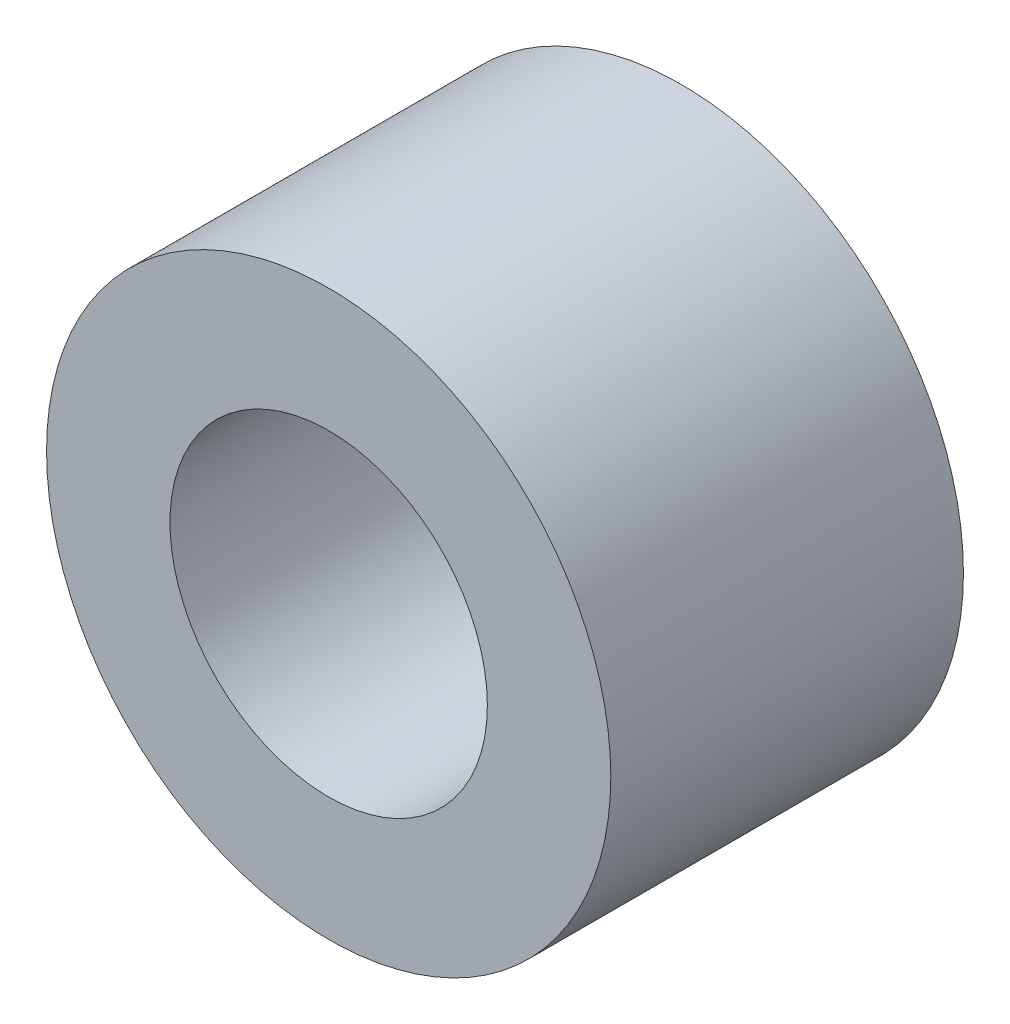
ISO-10303-21;
HEADER;
FILE_DESCRIPTION(('STEP AP214'),'2;1');
FILE_NAME('part.step','',(''),(''),'','','');
FILE_SCHEMA(('AUTOMOTIVE_DESIGN { 1 0 10303 214 1 1 1 1 }'));
ENDSEC;
DATA;
#1=APPLICATION_CONTEXT('core data for automotive mechanical design processes');
#2=APPLICATION_PROTOCOL_DEFINITION('international standard','automotive_design',2000,#1);
#3=PRODUCT_CONTEXT('',#1,'mechanical');
#4=PRODUCT('Part','Part','',(#3));
#5=PRODUCT_RELATED_PRODUCT_CATEGORY('part','',(#4));
#6=PRODUCT_DEFINITION_FORMATION('','',#4);
#7=PRODUCT_DEFINITION_CONTEXT('part definition',#1,'design');
#8=PRODUCT_DEFINITION('design','',#6,#7);
#9=PRODUCT_DEFINITION_SHAPE('','',#8);
#10=(LENGTH_UNIT() NAMED_UNIT(*) SI_UNIT(.MILLI.,.METRE.));
#11=(NAMED_UNIT(*) PLANE_ANGLE_UNIT() SI_UNIT($,.RADIAN.));
#12=(NAMED_UNIT(*) SI_UNIT($,.STERADIAN.) SOLID_ANGLE_UNIT());
#13=UNCERTAINTY_MEASURE_WITH_UNIT(LENGTH_MEASURE(1.E-05),#10,'distance_accuracy_value','');
#14=(GEOMETRIC_REPRESENTATION_CONTEXT(3) GLOBAL_UNCERTAINTY_ASSIGNED_CONTEXT((#13)) GLOBAL_UNIT_ASSIGNED_CONTEXT((#10,
#11,#12)) REPRESENTATION_CONTEXT('',''));
#15=CARTESIAN_POINT('',(0.,0.,0.));
#16=DIRECTION('',(0.,0.,1.));
#17=DIRECTION('',(1.,0.,0.));
#18=AXIS2_PLACEMENT_3D('',#15,#16,#17);
#19=CARTESIAN_POINT('',(0.,0.,5.));
#20=DIRECTION('',(0.,0.,1.));
#21=DIRECTION('',(1.,0.,0.));
#22=AXIS2_PLACEMENT_3D('',#19,#20,#21);
#23=PLANE('',#22);
#24=CARTESIAN_POINT('',(0.,0.,5.));
#25=DIRECTION('',(0.,0.,1.));
#26=DIRECTION('',(1.,0.,0.));
#27=AXIS2_PLACEMENT_3D('',#24,#25,#26);
#28=CIRCLE('',#27,4.);
#29=CARTESIAN_POINT('',(4.,0.,5.));
#30=VERTEX_POINT('',#29);
#31=EDGE_CURVE('E10',#30,#30,#28,.T.);
#32=ORIENTED_EDGE('',*,*,#31,.T.);
#33=EDGE_LOOP('',(#32));
#34=FACE_BOUND('',#33,.T.);
#35=CARTESIAN_POINT('',(0.,0.,5.));
#36=DIRECTION('',(0.,0.,1.));
#37=DIRECTION('',(1.,0.,0.));
#38=AXIS2_PLACEMENT_3D('',#35,#36,#37);
#39=CIRCLE('',#38,2.25);
#40=CARTESIAN_POINT('',(2.25,0.,5.));
#41=VERTEX_POINT('',#40);
#42=EDGE_CURVE('E48',#41,#41,#39,.T.);
#43=ORIENTED_EDGE('',*,*,#42,.F.);
#44=EDGE_LOOP('',(#43));
#45=FACE_BOUND('',#44,.T.);
#46=ADVANCED_FACE('F37',(#34,#45),#23,.T.);
#47=CARTESIAN_POINT('',(0.,0.,0.));
#48=DIRECTION('',(0.,0.,1.));
#49=DIRECTION('',(1.,0.,0.));
#50=AXIS2_PLACEMENT_3D('',#47,#48,#49);
#51=PLANE('',#50);
#52=CARTESIAN_POINT('',(0.,0.,0.));
#53=DIRECTION('',(0.,0.,1.));
#54=DIRECTION('',(1.,0.,0.));
#55=AXIS2_PLACEMENT_3D('',#52,#53,#54);
#56=CIRCLE('',#55,4.);
#57=CARTESIAN_POINT('',(4.,0.,0.));
#58=VERTEX_POINT('',#57);
#59=EDGE_CURVE('E41',#58,#58,#56,.T.);
#60=ORIENTED_EDGE('',*,*,#59,.F.);
#61=EDGE_LOOP('',(#60));
#62=FACE_BOUND('',#61,.T.);
#63=CARTESIAN_POINT('',(0.,0.,0.));
#64=DIRECTION('',(0.,0.,1.));
#65=DIRECTION('',(1.,0.,0.));
#66=AXIS2_PLACEMENT_3D('',#63,#64,#65);
#67=CIRCLE('',#66,2.25);
#68=CARTESIAN_POINT('',(2.25,0.,0.));
#69=VERTEX_POINT('',#68);
#70=EDGE_CURVE('E50',#69,#69,#67,.T.);
#71=ORIENTED_EDGE('',*,*,#70,.T.);
#72=EDGE_LOOP('',(#71));
#73=FACE_BOUND('',#72,.T.);
#74=ADVANCED_FACE('F60',(#62,#73),#51,.F.);
#75=CARTESIAN_POINT('',(0.,0.,5.));
#76=DIRECTION('',(0.,0.,-1.));
#77=DIRECTION('',(-1.,0.,0.));
#78=AXIS2_PLACEMENT_3D('',#75,#76,#77);
#79=CYLINDRICAL_SURFACE('',#78,4.);
#80=ORIENTED_EDGE('',*,*,#31,.F.);
#81=EDGE_LOOP('',(#80));
#82=FACE_BOUND('',#81,.T.);
#83=ORIENTED_EDGE('',*,*,#59,.T.);
#84=EDGE_LOOP('',(#83));
#85=FACE_BOUND('',#84,.T.);
#86=ADVANCED_FACE('F39',(#82,#85),#79,.T.);
#87=CARTESIAN_POINT('',(0.,0.,5.));
#88=DIRECTION('',(0.,0.,-1.));
#89=DIRECTION('',(-1.,0.,0.));
#90=AXIS2_PLACEMENT_3D('',#87,#88,#89);
#91=CYLINDRICAL_SURFACE('',#90,2.25);
#92=ORIENTED_EDGE('',*,*,#42,.T.);
#93=EDGE_LOOP('',(#92));
#94=FACE_BOUND('',#93,.T.);
#95=ORIENTED_EDGE('',*,*,#70,.F.);
#96=EDGE_LOOP('',(#95));
#97=FACE_BOUND('',#96,.T.);
#98=ADVANCED_FACE('F56',(#94,#97),#91,.F.);
#99=CLOSED_SHELL('',(#46,#74,#86,#98));
#100=MANIFOLD_SOLID_BREP('B2',#99);
#101=ADVANCED_BREP_SHAPE_REPRESENTATION('',(#18,#100),#14);
#102=SHAPE_DEFINITION_REPRESENTATION(#9,#101);
ENDSEC;
END-ISO-10303-21;
